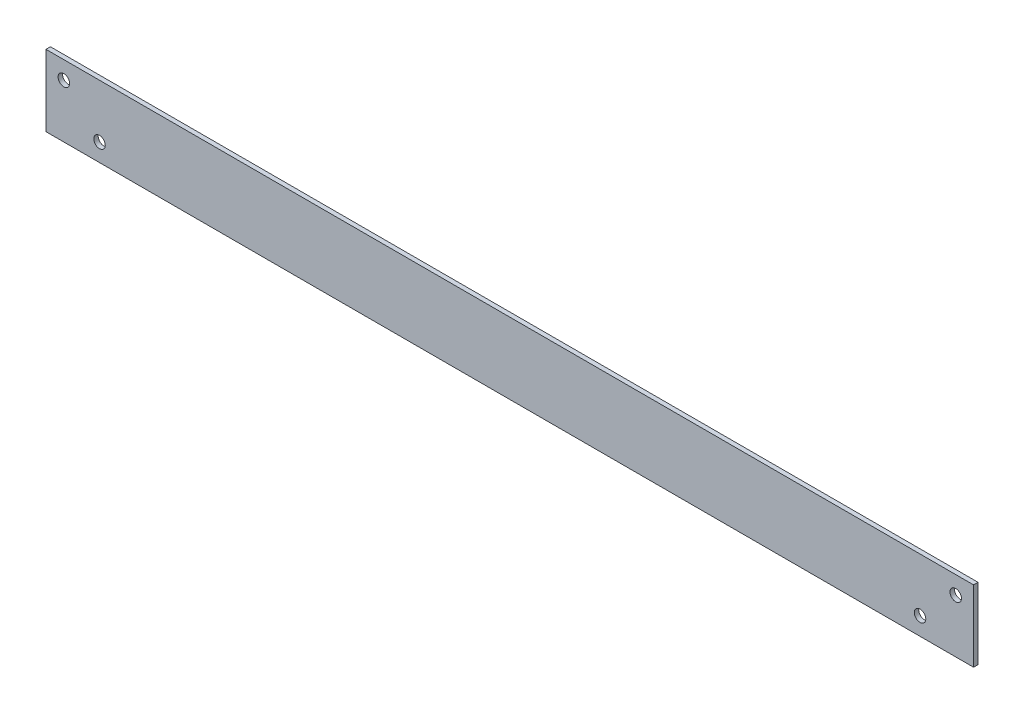
ISO-10303-21;
HEADER;
FILE_DESCRIPTION(('STEP AP214'),'2;1');
FILE_NAME('part.step','',(''),(''),'','','');
FILE_SCHEMA(('AUTOMOTIVE_DESIGN { 1 0 10303 214 1 1 1 1 }'));
ENDSEC;
DATA;
#1=APPLICATION_CONTEXT('core data for automotive mechanical design processes');
#2=APPLICATION_PROTOCOL_DEFINITION('international standard','automotive_design',2000,#1);
#3=PRODUCT_CONTEXT('',#1,'mechanical');
#4=PRODUCT('Part','Part','',(#3));
#5=PRODUCT_RELATED_PRODUCT_CATEGORY('part','',(#4));
#6=PRODUCT_DEFINITION_FORMATION('','',#4);
#7=PRODUCT_DEFINITION_CONTEXT('part definition',#1,'design');
#8=PRODUCT_DEFINITION('design','',#6,#7);
#9=PRODUCT_DEFINITION_SHAPE('','',#8);
#10=(LENGTH_UNIT() NAMED_UNIT(*) SI_UNIT(.MILLI.,.METRE.));
#11=(NAMED_UNIT(*) PLANE_ANGLE_UNIT() SI_UNIT($,.RADIAN.));
#12=(NAMED_UNIT(*) SI_UNIT($,.STERADIAN.) SOLID_ANGLE_UNIT());
#13=UNCERTAINTY_MEASURE_WITH_UNIT(LENGTH_MEASURE(1.E-05),#10,'distance_accuracy_value','');
#14=(GEOMETRIC_REPRESENTATION_CONTEXT(3) GLOBAL_UNCERTAINTY_ASSIGNED_CONTEXT((#13)) GLOBAL_UNIT_ASSIGNED_CONTEXT((#10,
#11,#12)) REPRESENTATION_CONTEXT('',''));
#15=CARTESIAN_POINT('',(0.,0.,0.));
#16=DIRECTION('',(0.,0.,1.));
#17=DIRECTION('',(1.,0.,0.));
#18=AXIS2_PLACEMENT_3D('',#15,#16,#17);
#19=CARTESIAN_POINT('',(0.,12.7,1.5875));
#20=DIRECTION('',(0.,1.,0.));
#21=DIRECTION('',(-1.,0.,0.));
#22=AXIS2_PLACEMENT_3D('',#19,#20,#21);
#23=PLANE('',#22);
#24=DIRECTION('',(1.,0.,0.));
#25=VECTOR('',#24,1.);
#26=CARTESIAN_POINT('',(0.,12.7,0.));
#27=LINE('',#26,#25);
#28=CARTESIAN_POINT('',(-165.1,12.7,0.));
#29=VERTEX_POINT('',#28);
#30=CARTESIAN_POINT('',(165.1,12.7,0.));
#31=VERTEX_POINT('',#30);
#32=EDGE_CURVE('E118',#29,#31,#27,.T.);
#33=ORIENTED_EDGE('',*,*,#32,.F.);
#34=DIRECTION('',(0.,0.,-1.));
#35=VECTOR('',#34,1.);
#36=CARTESIAN_POINT('',(-165.1,12.7,1.5875));
#37=LINE('',#36,#35);
#38=CARTESIAN_POINT('',(-165.1,12.7,1.5875));
#39=VERTEX_POINT('',#38);
#40=EDGE_CURVE('E11',#39,#29,#37,.T.);
#41=ORIENTED_EDGE('',*,*,#40,.F.);
#42=DIRECTION('',(1.,0.,0.));
#43=VECTOR('',#42,1.);
#44=CARTESIAN_POINT('',(0.,12.7,1.5875));
#45=LINE('',#44,#43);
#46=CARTESIAN_POINT('',(165.1,12.7,1.5875));
#47=VERTEX_POINT('',#46);
#48=EDGE_CURVE('E99',#39,#47,#45,.T.);
#49=ORIENTED_EDGE('',*,*,#48,.T.);
#50=DIRECTION('',(0.,0.,-1.));
#51=VECTOR('',#50,1.);
#52=CARTESIAN_POINT('',(165.1,12.7,1.5875));
#53=LINE('',#52,#51);
#54=EDGE_CURVE('E80',#47,#31,#53,.T.);
#55=ORIENTED_EDGE('',*,*,#54,.T.);
#56=EDGE_LOOP('',(#33,#41,#49,#55));
#57=FACE_BOUND('',#56,.T.);
#58=ADVANCED_FACE('F41',(#57),#23,.T.);
#59=CARTESIAN_POINT('',(-165.1,0.,1.5875));
#60=DIRECTION('',(-1.,0.,0.));
#61=DIRECTION('',(0.,0.,1.));
#62=AXIS2_PLACEMENT_3D('',#59,#60,#61);
#63=PLANE('',#62);
#64=DIRECTION('',(0.,1.,0.));
#65=VECTOR('',#64,1.);
#66=CARTESIAN_POINT('',(-165.1,0.,0.));
#67=LINE('',#66,#65);
#68=CARTESIAN_POINT('',(-165.1,-12.7,0.));
#69=VERTEX_POINT('',#68);
#70=EDGE_CURVE('E91',#69,#29,#67,.T.);
#71=ORIENTED_EDGE('',*,*,#70,.F.);
#72=DIRECTION('',(0.,0.,-1.));
#73=VECTOR('',#72,1.);
#74=CARTESIAN_POINT('',(-165.1,-12.7,1.5875));
#75=LINE('',#74,#73);
#76=CARTESIAN_POINT('',(-165.1,-12.7,1.5875));
#77=VERTEX_POINT('',#76);
#78=EDGE_CURVE('E50',#77,#69,#75,.T.);
#79=ORIENTED_EDGE('',*,*,#78,.F.);
#80=DIRECTION('',(0.,1.,0.));
#81=VECTOR('',#80,1.);
#82=CARTESIAN_POINT('',(-165.1,0.,1.5875));
#83=LINE('',#82,#81);
#84=EDGE_CURVE('E89',#77,#39,#83,.T.);
#85=ORIENTED_EDGE('',*,*,#84,.T.);
#86=ORIENTED_EDGE('',*,*,#40,.T.);
#87=EDGE_LOOP('',(#71,#79,#85,#86));
#88=FACE_BOUND('',#87,.T.);
#89=ADVANCED_FACE('F88',(#88),#63,.T.);
#90=CARTESIAN_POINT('',(0.,-12.7,1.5875));
#91=DIRECTION('',(0.,-1.,0.));
#92=DIRECTION('',(1.,0.,0.));
#93=AXIS2_PLACEMENT_3D('',#90,#91,#92);
#94=PLANE('',#93);
#95=DIRECTION('',(-1.,0.,0.));
#96=VECTOR('',#95,1.);
#97=CARTESIAN_POINT('',(0.,-12.7,0.));
#98=LINE('',#97,#96);
#99=CARTESIAN_POINT('',(165.1,-12.7,0.));
#100=VERTEX_POINT('',#99);
#101=EDGE_CURVE('E122',#100,#69,#98,.T.);
#102=ORIENTED_EDGE('',*,*,#101,.F.);
#103=DIRECTION('',(0.,0.,-1.));
#104=VECTOR('',#103,1.);
#105=CARTESIAN_POINT('',(165.1,-12.7,1.5875));
#106=LINE('',#105,#104);
#107=CARTESIAN_POINT('',(165.1,-12.7,1.5875));
#108=VERTEX_POINT('',#107);
#109=EDGE_CURVE('E73',#108,#100,#106,.T.);
#110=ORIENTED_EDGE('',*,*,#109,.F.);
#111=DIRECTION('',(-1.,0.,0.));
#112=VECTOR('',#111,1.);
#113=CARTESIAN_POINT('',(0.,-12.7,1.5875));
#114=LINE('',#113,#112);
#115=EDGE_CURVE('E98',#108,#77,#114,.T.);
#116=ORIENTED_EDGE('',*,*,#115,.T.);
#117=ORIENTED_EDGE('',*,*,#78,.T.);
#118=EDGE_LOOP('',(#102,#110,#116,#117));
#119=FACE_BOUND('',#118,.T.);
#120=ADVANCED_FACE('F101',(#119),#94,.T.);
#121=CARTESIAN_POINT('',(146.05,-6.34999999999996,1.5875));
#122=DIRECTION('',(0.,0.,-1.));
#123=DIRECTION('',(-1.,0.,0.));
#124=AXIS2_PLACEMENT_3D('',#121,#122,#123);
#125=CYLINDRICAL_SURFACE('',#124,2.04999999999999);
#126=CARTESIAN_POINT('',(146.05,-6.34999999999996,1.5875));
#127=DIRECTION('',(0.,0.,1.));
#128=DIRECTION('',(1.,0.,0.));
#129=AXIS2_PLACEMENT_3D('',#126,#127,#128);
#130=CIRCLE('',#129,2.04999999999999);
#131=CARTESIAN_POINT('',(148.1,-6.34999999999996,1.5875));
#132=VERTEX_POINT('',#131);
#133=EDGE_CURVE('E103',#132,#132,#130,.F.);
#134=ORIENTED_EDGE('',*,*,#133,.F.);
#135=EDGE_LOOP('',(#134));
#136=FACE_BOUND('',#135,.T.);
#137=CARTESIAN_POINT('',(146.05,-6.34999999999996,0.));
#138=DIRECTION('',(0.,0.,1.));
#139=DIRECTION('',(1.,0.,0.));
#140=AXIS2_PLACEMENT_3D('',#137,#138,#139);
#141=CIRCLE('',#140,2.04999999999999);
#142=CARTESIAN_POINT('',(148.1,-6.34999999999996,0.));
#143=VERTEX_POINT('',#142);
#144=EDGE_CURVE('E126',#143,#143,#141,.F.);
#145=ORIENTED_EDGE('',*,*,#144,.T.);
#146=EDGE_LOOP('',(#145));
#147=FACE_BOUND('',#146,.T.);
#148=ADVANCED_FACE('F159',(#136,#147),#125,.F.);
#149=CARTESIAN_POINT('',(165.1,0.,1.5875));
#150=DIRECTION('',(-1.,0.,0.));
#151=DIRECTION('',(0.,0.,1.));
#152=AXIS2_PLACEMENT_3D('',#149,#150,#151);
#153=PLANE('',#152);
#154=DIRECTION('',(0.,1.,0.));
#155=VECTOR('',#154,1.);
#156=CARTESIAN_POINT('',(165.1,0.,0.));
#157=LINE('',#156,#155);
#158=EDGE_CURVE('E124',#100,#31,#157,.T.);
#159=ORIENTED_EDGE('',*,*,#158,.T.);
#160=ORIENTED_EDGE('',*,*,#54,.F.);
#161=DIRECTION('',(0.,1.,0.));
#162=VECTOR('',#161,1.);
#163=CARTESIAN_POINT('',(165.1,0.,1.5875));
#164=LINE('',#163,#162);
#165=EDGE_CURVE('E58',#108,#47,#164,.T.);
#166=ORIENTED_EDGE('',*,*,#165,.F.);
#167=ORIENTED_EDGE('',*,*,#109,.T.);
#168=EDGE_LOOP('',(#159,#160,#166,#167));
#169=FACE_BOUND('',#168,.T.);
#170=ADVANCED_FACE('F152',(#169),#153,.F.);
#171=CARTESIAN_POINT('',(-158.75,6.35,1.5875));
#172=DIRECTION('',(0.,0.,-1.));
#173=DIRECTION('',(-1.,0.,0.));
#174=AXIS2_PLACEMENT_3D('',#171,#172,#173);
#175=CYLINDRICAL_SURFACE('',#174,2.04999999999999);
#176=CARTESIAN_POINT('',(-158.75,6.35,1.5875));
#177=DIRECTION('',(0.,0.,1.));
#178=DIRECTION('',(1.,0.,0.));
#179=AXIS2_PLACEMENT_3D('',#176,#177,#178);
#180=CIRCLE('',#179,2.04999999999999);
#181=CARTESIAN_POINT('',(-156.7,6.35,1.5875));
#182=VERTEX_POINT('',#181);
#183=EDGE_CURVE('E137',#182,#182,#180,.T.);
#184=ORIENTED_EDGE('',*,*,#183,.T.);
#185=EDGE_LOOP('',(#184));
#186=FACE_BOUND('',#185,.T.);
#187=CARTESIAN_POINT('',(-158.75,6.35,0.));
#188=DIRECTION('',(0.,0.,1.));
#189=DIRECTION('',(1.,0.,0.));
#190=AXIS2_PLACEMENT_3D('',#187,#188,#189);
#191=CIRCLE('',#190,2.04999999999999);
#192=CARTESIAN_POINT('',(-156.7,6.35,0.));
#193=VERTEX_POINT('',#192);
#194=EDGE_CURVE('E115',#193,#193,#191,.T.);
#195=ORIENTED_EDGE('',*,*,#194,.F.);
#196=EDGE_LOOP('',(#195));
#197=FACE_BOUND('',#196,.T.);
#198=ADVANCED_FACE('F150',(#186,#197),#175,.F.);
#199=CARTESIAN_POINT('',(-146.05,-6.35,1.5875));
#200=DIRECTION('',(0.,0.,-1.));
#201=DIRECTION('',(-1.,0.,0.));
#202=AXIS2_PLACEMENT_3D('',#199,#200,#201);
#203=CYLINDRICAL_SURFACE('',#202,2.04999999999999);
#204=CARTESIAN_POINT('',(-146.05,-6.35,1.5875));
#205=DIRECTION('',(0.,0.,1.));
#206=DIRECTION('',(1.,0.,0.));
#207=AXIS2_PLACEMENT_3D('',#204,#205,#206);
#208=CIRCLE('',#207,2.04999999999999);
#209=CARTESIAN_POINT('',(-144.,-6.35,1.5875));
#210=VERTEX_POINT('',#209);
#211=EDGE_CURVE('E132',#210,#210,#208,.T.);
#212=ORIENTED_EDGE('',*,*,#211,.T.);
#213=EDGE_LOOP('',(#212));
#214=FACE_BOUND('',#213,.T.);
#215=CARTESIAN_POINT('',(-146.05,-6.35,0.));
#216=DIRECTION('',(0.,0.,1.));
#217=DIRECTION('',(1.,0.,0.));
#218=AXIS2_PLACEMENT_3D('',#215,#216,#217);
#219=CIRCLE('',#218,2.04999999999999);
#220=CARTESIAN_POINT('',(-144.,-6.35,0.));
#221=VERTEX_POINT('',#220);
#222=EDGE_CURVE('E112',#221,#221,#219,.T.);
#223=ORIENTED_EDGE('',*,*,#222,.F.);
#224=EDGE_LOOP('',(#223));
#225=FACE_BOUND('',#224,.T.);
#226=ADVANCED_FACE('F43',(#214,#225),#203,.F.);
#227=CARTESIAN_POINT('',(158.75,6.35000000000004,1.5875));
#228=DIRECTION('',(0.,0.,-1.));
#229=DIRECTION('',(-1.,0.,0.));
#230=AXIS2_PLACEMENT_3D('',#227,#228,#229);
#231=CYLINDRICAL_SURFACE('',#230,2.04999999999999);
#232=CARTESIAN_POINT('',(158.75,6.35000000000004,1.5875));
#233=DIRECTION('',(0.,0.,1.));
#234=DIRECTION('',(1.,0.,0.));
#235=AXIS2_PLACEMENT_3D('',#232,#233,#234);
#236=CIRCLE('',#235,2.04999999999999);
#237=CARTESIAN_POINT('',(160.8,6.35000000000004,1.5875));
#238=VERTEX_POINT('',#237);
#239=EDGE_CURVE('E109',#238,#238,#236,.F.);
#240=ORIENTED_EDGE('',*,*,#239,.F.);
#241=EDGE_LOOP('',(#240));
#242=FACE_BOUND('',#241,.T.);
#243=CARTESIAN_POINT('',(158.75,6.35000000000004,0.));
#244=DIRECTION('',(0.,0.,1.));
#245=DIRECTION('',(1.,0.,0.));
#246=AXIS2_PLACEMENT_3D('',#243,#244,#245);
#247=CIRCLE('',#246,2.04999999999999);
#248=CARTESIAN_POINT('',(160.8,6.35000000000004,0.));
#249=VERTEX_POINT('',#248);
#250=EDGE_CURVE('E129',#249,#249,#247,.F.);
#251=ORIENTED_EDGE('',*,*,#250,.T.);
#252=EDGE_LOOP('',(#251));
#253=FACE_BOUND('',#252,.T.);
#254=ADVANCED_FACE('F158',(#242,#253),#231,.F.);
#255=CARTESIAN_POINT('',(0.,0.,1.5875));
#256=DIRECTION('',(0.,0.,1.));
#257=DIRECTION('',(1.,0.,0.));
#258=AXIS2_PLACEMENT_3D('',#255,#256,#257);
#259=PLANE('',#258);
#260=ORIENTED_EDGE('',*,*,#211,.F.);
#261=EDGE_LOOP('',(#260));
#262=FACE_BOUND('',#261,.T.);
#263=ORIENTED_EDGE('',*,*,#183,.F.);
#264=EDGE_LOOP('',(#263));
#265=FACE_BOUND('',#264,.T.);
#266=ORIENTED_EDGE('',*,*,#48,.F.);
#267=ORIENTED_EDGE('',*,*,#84,.F.);
#268=ORIENTED_EDGE('',*,*,#115,.F.);
#269=ORIENTED_EDGE('',*,*,#165,.T.);
#270=EDGE_LOOP('',(#266,#267,#268,#269));
#271=FACE_BOUND('',#270,.T.);
#272=ORIENTED_EDGE('',*,*,#133,.T.);
#273=EDGE_LOOP('',(#272));
#274=FACE_BOUND('',#273,.T.);
#275=ORIENTED_EDGE('',*,*,#239,.T.);
#276=EDGE_LOOP('',(#275));
#277=FACE_BOUND('',#276,.T.);
#278=ADVANCED_FACE('F96',(#262,#265,#271,#274,#277),#259,.T.);
#279=CARTESIAN_POINT('',(0.,0.,0.));
#280=DIRECTION('',(0.,0.,1.));
#281=DIRECTION('',(1.,0.,0.));
#282=AXIS2_PLACEMENT_3D('',#279,#280,#281);
#283=PLANE('',#282);
#284=ORIENTED_EDGE('',*,*,#222,.T.);
#285=EDGE_LOOP('',(#284));
#286=FACE_BOUND('',#285,.T.);
#287=ORIENTED_EDGE('',*,*,#194,.T.);
#288=EDGE_LOOP('',(#287));
#289=FACE_BOUND('',#288,.T.);
#290=ORIENTED_EDGE('',*,*,#32,.T.);
#291=ORIENTED_EDGE('',*,*,#158,.F.);
#292=ORIENTED_EDGE('',*,*,#101,.T.);
#293=ORIENTED_EDGE('',*,*,#70,.T.);
#294=EDGE_LOOP('',(#290,#291,#292,#293));
#295=FACE_BOUND('',#294,.T.);
#296=ORIENTED_EDGE('',*,*,#144,.F.);
#297=EDGE_LOOP('',(#296));
#298=FACE_BOUND('',#297,.T.);
#299=ORIENTED_EDGE('',*,*,#250,.F.);
#300=EDGE_LOOP('',(#299));
#301=FACE_BOUND('',#300,.T.);
#302=ADVANCED_FACE('F165',(#286,#289,#295,#298,#301),#283,.F.);
#303=CLOSED_SHELL('',(#58,#89,#120,#148,#170,#198,#226,#254,#278,#302));
#304=MANIFOLD_SOLID_BREP('B2',#303);
#305=ADVANCED_BREP_SHAPE_REPRESENTATION('',(#18,#304),#14);
#306=SHAPE_DEFINITION_REPRESENTATION(#9,#305);
ENDSEC;
END-ISO-10303-21;
